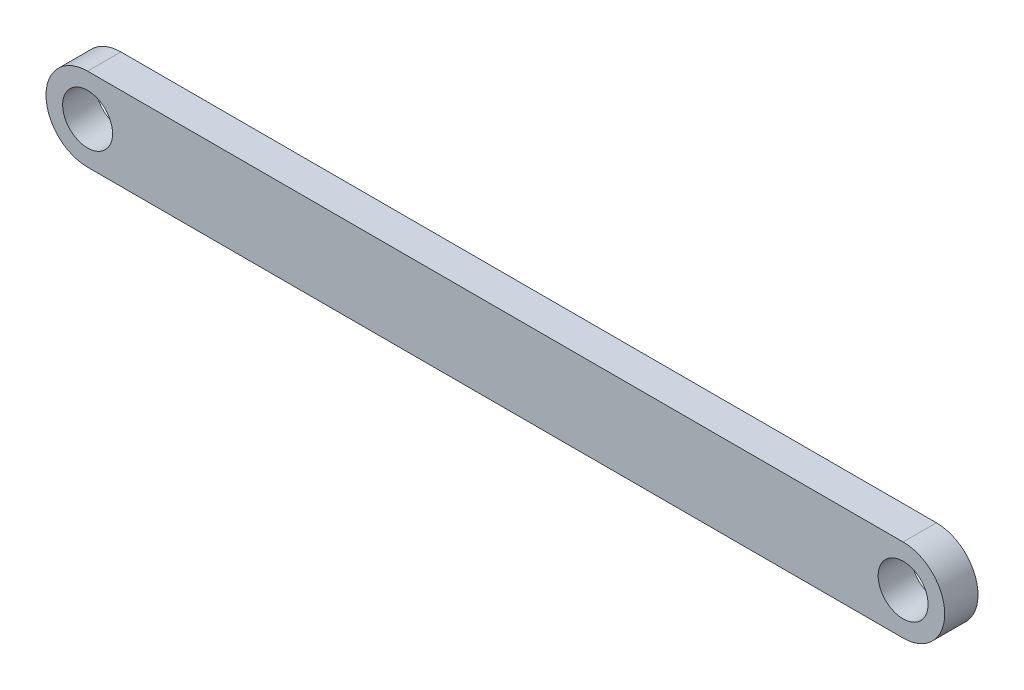
ISO-10303-21;
HEADER;
FILE_DESCRIPTION(('STEP AP214'),'2;1');
FILE_NAME('part.step','',(''),(''),'','','');
FILE_SCHEMA(('AUTOMOTIVE_DESIGN { 1 0 10303 214 1 1 1 1 }'));
ENDSEC;
DATA;
#1=APPLICATION_CONTEXT('core data for automotive mechanical design processes');
#2=APPLICATION_PROTOCOL_DEFINITION('international standard','automotive_design',2000,#1);
#3=PRODUCT_CONTEXT('',#1,'mechanical');
#4=PRODUCT('Part','Part','',(#3));
#5=PRODUCT_RELATED_PRODUCT_CATEGORY('part','',(#4));
#6=PRODUCT_DEFINITION_FORMATION('','',#4);
#7=PRODUCT_DEFINITION_CONTEXT('part definition',#1,'design');
#8=PRODUCT_DEFINITION('design','',#6,#7);
#9=PRODUCT_DEFINITION_SHAPE('','',#8);
#10=(LENGTH_UNIT() NAMED_UNIT(*) SI_UNIT(.MILLI.,.METRE.));
#11=(NAMED_UNIT(*) PLANE_ANGLE_UNIT() SI_UNIT($,.RADIAN.));
#12=(NAMED_UNIT(*) SI_UNIT($,.STERADIAN.) SOLID_ANGLE_UNIT());
#13=UNCERTAINTY_MEASURE_WITH_UNIT(LENGTH_MEASURE(1.E-05),#10,'distance_accuracy_value','');
#14=(GEOMETRIC_REPRESENTATION_CONTEXT(3) GLOBAL_UNCERTAINTY_ASSIGNED_CONTEXT((#13)) GLOBAL_UNIT_ASSIGNED_CONTEXT((#10,
#11,#12)) REPRESENTATION_CONTEXT('',''));
#15=CARTESIAN_POINT('',(0.,0.,0.));
#16=DIRECTION('',(0.,0.,1.));
#17=DIRECTION('',(1.,0.,0.));
#18=AXIS2_PLACEMENT_3D('',#15,#16,#17);
#19=CARTESIAN_POINT('',(0.0557614850425769,-0.167823658648234,2.));
#20=DIRECTION('',(0.,0.,1.));
#21=DIRECTION('',(1.,0.,0.));
#22=AXIS2_PLACEMENT_3D('',#19,#20,#21);
#23=PLANE('',#22);
#24=CARTESIAN_POINT('',(0.0557614850425769,-0.167823658648235,2.));
#25=DIRECTION('',(0.,0.,1.));
#26=DIRECTION('',(1.,0.,0.));
#27=AXIS2_PLACEMENT_3D('',#24,#25,#26);
#28=CIRCLE('',#27,1.5);
#29=CARTESIAN_POINT('',(1.55576148504258,-0.167823658648235,2.));
#30=VERTEX_POINT('',#29);
#31=EDGE_CURVE('E99',#30,#30,#28,.T.);
#32=ORIENTED_EDGE('',*,*,#31,.F.);
#33=EDGE_LOOP('',(#32));
#34=FACE_BOUND('',#33,.T.);
#35=CARTESIAN_POINT('',(0.0557614850425769,-0.167823658648234,2.));
#36=DIRECTION('',(0.,0.,1.));
#37=DIRECTION('',(1.,0.,0.));
#38=AXIS2_PLACEMENT_3D('',#35,#36,#37);
#39=CIRCLE('',#38,2.5);
#40=CARTESIAN_POINT('',(0.0557614850425769,2.33217634135177,2.));
#41=VERTEX_POINT('',#40);
#42=CARTESIAN_POINT('',(0.0557614850425769,-2.66782365864823,2.));
#43=VERTEX_POINT('',#42);
#44=EDGE_CURVE('E84',#41,#43,#39,.T.);
#45=ORIENTED_EDGE('',*,*,#44,.T.);
#46=DIRECTION('',(1.,0.,0.));
#47=VECTOR('',#46,1.);
#48=CARTESIAN_POINT('',(0.0557614850425769,-2.66782365864823,2.));
#49=LINE('',#48,#47);
#50=CARTESIAN_POINT('',(49.0557614850426,-2.66782365864823,2.));
#51=VERTEX_POINT('',#50);
#52=EDGE_CURVE('E79',#43,#51,#49,.T.);
#53=ORIENTED_EDGE('',*,*,#52,.T.);
#54=CARTESIAN_POINT('',(49.0557614850426,-0.167823658648234,2.));
#55=DIRECTION('',(0.,0.,1.));
#56=DIRECTION('',(1.,0.,0.));
#57=AXIS2_PLACEMENT_3D('',#54,#55,#56);
#58=CIRCLE('',#57,2.5);
#59=CARTESIAN_POINT('',(49.0557614850426,2.33217634135177,2.));
#60=VERTEX_POINT('',#59);
#61=EDGE_CURVE('E82',#51,#60,#58,.T.);
#62=ORIENTED_EDGE('',*,*,#61,.T.);
#63=DIRECTION('',(-1.,0.,0.));
#64=VECTOR('',#63,1.);
#65=CARTESIAN_POINT('',(0.0557614850425769,2.33217634135177,2.));
#66=LINE('',#65,#64);
#67=EDGE_CURVE('E49',#60,#41,#66,.T.);
#68=ORIENTED_EDGE('',*,*,#67,.T.);
#69=EDGE_LOOP('',(#45,#53,#62,#68));
#70=FACE_BOUND('',#69,.T.);
#71=CARTESIAN_POINT('',(49.0557614850426,-0.167823658648235,2.));
#72=DIRECTION('',(0.,0.,1.));
#73=DIRECTION('',(1.,0.,0.));
#74=AXIS2_PLACEMENT_3D('',#71,#72,#73);
#75=CIRCLE('',#74,1.5);
#76=CARTESIAN_POINT('',(50.5557614850426,-0.167823658648235,2.));
#77=VERTEX_POINT('',#76);
#78=EDGE_CURVE('E114',#77,#77,#75,.T.);
#79=ORIENTED_EDGE('',*,*,#78,.F.);
#80=EDGE_LOOP('',(#79));
#81=FACE_BOUND('',#80,.T.);
#82=ADVANCED_FACE('F32',(#34,#70,#81),#23,.T.);
#83=CARTESIAN_POINT('',(0.0557614850425769,-0.167823658648234,0.));
#84=DIRECTION('',(0.,0.,1.));
#85=DIRECTION('',(1.,0.,0.));
#86=AXIS2_PLACEMENT_3D('',#83,#84,#85);
#87=PLANE('',#86);
#88=CARTESIAN_POINT('',(0.0557614850425769,-0.167823658648234,0.));
#89=DIRECTION('',(0.,0.,1.));
#90=DIRECTION('',(1.,0.,0.));
#91=AXIS2_PLACEMENT_3D('',#88,#89,#90);
#92=CIRCLE('',#91,2.5);
#93=CARTESIAN_POINT('',(0.0557614850425769,2.33217634135177,0.));
#94=VERTEX_POINT('',#93);
#95=CARTESIAN_POINT('',(0.0557614850425769,-2.66782365864823,0.));
#96=VERTEX_POINT('',#95);
#97=EDGE_CURVE('E96',#94,#96,#92,.T.);
#98=ORIENTED_EDGE('',*,*,#97,.F.);
#99=DIRECTION('',(-1.,0.,0.));
#100=VECTOR('',#99,1.);
#101=CARTESIAN_POINT('',(0.0557614850425769,2.33217634135177,0.));
#102=LINE('',#101,#100);
#103=CARTESIAN_POINT('',(49.0557614850426,2.33217634135177,0.));
#104=VERTEX_POINT('',#103);
#105=EDGE_CURVE('E72',#104,#94,#102,.T.);
#106=ORIENTED_EDGE('',*,*,#105,.F.);
#107=CARTESIAN_POINT('',(49.0557614850426,-0.167823658648234,0.));
#108=DIRECTION('',(0.,0.,1.));
#109=DIRECTION('',(1.,0.,0.));
#110=AXIS2_PLACEMENT_3D('',#107,#108,#109);
#111=CIRCLE('',#110,2.5);
#112=CARTESIAN_POINT('',(49.0557614850426,-2.66782365864823,0.));
#113=VERTEX_POINT('',#112);
#114=EDGE_CURVE('E66',#113,#104,#111,.T.);
#115=ORIENTED_EDGE('',*,*,#114,.F.);
#116=DIRECTION('',(1.,0.,0.));
#117=VECTOR('',#116,1.);
#118=CARTESIAN_POINT('',(0.0557614850425769,-2.66782365864823,0.));
#119=LINE('',#118,#117);
#120=EDGE_CURVE('E88',#96,#113,#119,.T.);
#121=ORIENTED_EDGE('',*,*,#120,.F.);
#122=EDGE_LOOP('',(#98,#106,#115,#121));
#123=FACE_BOUND('',#122,.T.);
#124=CARTESIAN_POINT('',(0.0557614850425769,-0.167823658648235,0.));
#125=DIRECTION('',(0.,0.,1.));
#126=DIRECTION('',(1.,0.,0.));
#127=AXIS2_PLACEMENT_3D('',#124,#125,#126);
#128=CIRCLE('',#127,1.5);
#129=CARTESIAN_POINT('',(1.55576148504258,-0.167823658648235,0.));
#130=VERTEX_POINT('',#129);
#131=EDGE_CURVE('E111',#130,#130,#128,.T.);
#132=ORIENTED_EDGE('',*,*,#131,.T.);
#133=EDGE_LOOP('',(#132));
#134=FACE_BOUND('',#133,.T.);
#135=CARTESIAN_POINT('',(49.0557614850426,-0.167823658648235,0.));
#136=DIRECTION('',(0.,0.,1.));
#137=DIRECTION('',(1.,0.,0.));
#138=AXIS2_PLACEMENT_3D('',#135,#136,#137);
#139=CIRCLE('',#138,1.5);
#140=CARTESIAN_POINT('',(50.5557614850426,-0.167823658648235,0.));
#141=VERTEX_POINT('',#140);
#142=EDGE_CURVE('E117',#141,#141,#139,.T.);
#143=ORIENTED_EDGE('',*,*,#142,.T.);
#144=EDGE_LOOP('',(#143));
#145=FACE_BOUND('',#144,.T.);
#146=ADVANCED_FACE('F107',(#123,#134,#145),#87,.F.);
#147=CARTESIAN_POINT('',(0.0557614850425769,-0.167823658648234,2.));
#148=DIRECTION('',(0.,0.,-1.));
#149=DIRECTION('',(-1.,0.,0.));
#150=AXIS2_PLACEMENT_3D('',#147,#148,#149);
#151=CYLINDRICAL_SURFACE('',#150,2.5);
#152=ORIENTED_EDGE('',*,*,#97,.T.);
#153=DIRECTION('',(0.,0.,-1.));
#154=VECTOR('',#153,1.);
#155=CARTESIAN_POINT('',(0.0557614850425769,-2.66782365864823,2.));
#156=LINE('',#155,#154);
#157=EDGE_CURVE('E11',#43,#96,#156,.T.);
#158=ORIENTED_EDGE('',*,*,#157,.F.);
#159=ORIENTED_EDGE('',*,*,#44,.F.);
#160=DIRECTION('',(0.,0.,-1.));
#161=VECTOR('',#160,1.);
#162=CARTESIAN_POINT('',(0.0557614850425769,2.33217634135177,2.));
#163=LINE('',#162,#161);
#164=EDGE_CURVE('E92',#41,#94,#163,.T.);
#165=ORIENTED_EDGE('',*,*,#164,.T.);
#166=EDGE_LOOP('',(#152,#158,#159,#165));
#167=FACE_BOUND('',#166,.T.);
#168=ADVANCED_FACE('F34',(#167),#151,.T.);
#169=CARTESIAN_POINT('',(0.0557614850425769,-2.66782365864823,2.));
#170=DIRECTION('',(0.,1.,0.));
#171=DIRECTION('',(0.,0.,1.));
#172=AXIS2_PLACEMENT_3D('',#169,#170,#171);
#173=PLANE('',#172);
#174=ORIENTED_EDGE('',*,*,#120,.T.);
#175=DIRECTION('',(0.,0.,-1.));
#176=VECTOR('',#175,1.);
#177=CARTESIAN_POINT('',(49.0557614850426,-2.66782365864823,2.));
#178=LINE('',#177,#176);
#179=EDGE_CURVE('E41',#51,#113,#178,.T.);
#180=ORIENTED_EDGE('',*,*,#179,.F.);
#181=ORIENTED_EDGE('',*,*,#52,.F.);
#182=ORIENTED_EDGE('',*,*,#157,.T.);
#183=EDGE_LOOP('',(#174,#180,#181,#182));
#184=FACE_BOUND('',#183,.T.);
#185=ADVANCED_FACE('F87',(#184),#173,.F.);
#186=CARTESIAN_POINT('',(49.0557614850426,-0.167823658648234,2.));
#187=DIRECTION('',(0.,0.,-1.));
#188=DIRECTION('',(-1.,0.,0.));
#189=AXIS2_PLACEMENT_3D('',#186,#187,#188);
#190=CYLINDRICAL_SURFACE('',#189,2.5);
#191=ORIENTED_EDGE('',*,*,#114,.T.);
#192=DIRECTION('',(0.,0.,-1.));
#193=VECTOR('',#192,1.);
#194=CARTESIAN_POINT('',(49.0557614850426,2.33217634135177,2.));
#195=LINE('',#194,#193);
#196=EDGE_CURVE('E89',#60,#104,#195,.T.);
#197=ORIENTED_EDGE('',*,*,#196,.F.);
#198=ORIENTED_EDGE('',*,*,#61,.F.);
#199=ORIENTED_EDGE('',*,*,#179,.T.);
#200=EDGE_LOOP('',(#191,#197,#198,#199));
#201=FACE_BOUND('',#200,.T.);
#202=ADVANCED_FACE('F90',(#201),#190,.T.);
#203=CARTESIAN_POINT('',(0.0557614850425769,2.33217634135177,2.));
#204=DIRECTION('',(0.,-1.,0.));
#205=DIRECTION('',(0.,0.,-1.));
#206=AXIS2_PLACEMENT_3D('',#203,#204,#205);
#207=PLANE('',#206);
#208=ORIENTED_EDGE('',*,*,#105,.T.);
#209=ORIENTED_EDGE('',*,*,#164,.F.);
#210=ORIENTED_EDGE('',*,*,#67,.F.);
#211=ORIENTED_EDGE('',*,*,#196,.T.);
#212=EDGE_LOOP('',(#208,#209,#210,#211));
#213=FACE_BOUND('',#212,.T.);
#214=ADVANCED_FACE('F104',(#213),#207,.F.);
#215=CARTESIAN_POINT('',(0.0557614850425769,-0.167823658648235,2.));
#216=DIRECTION('',(0.,0.,-1.));
#217=DIRECTION('',(-1.,0.,0.));
#218=AXIS2_PLACEMENT_3D('',#215,#216,#217);
#219=CYLINDRICAL_SURFACE('',#218,1.5);
#220=ORIENTED_EDGE('',*,*,#31,.T.);
#221=EDGE_LOOP('',(#220));
#222=FACE_BOUND('',#221,.T.);
#223=ORIENTED_EDGE('',*,*,#131,.F.);
#224=EDGE_LOOP('',(#223));
#225=FACE_BOUND('',#224,.T.);
#226=ADVANCED_FACE('F134',(#222,#225),#219,.F.);
#227=CARTESIAN_POINT('',(49.0557614850426,-0.167823658648235,2.));
#228=DIRECTION('',(0.,0.,-1.));
#229=DIRECTION('',(-1.,0.,0.));
#230=AXIS2_PLACEMENT_3D('',#227,#228,#229);
#231=CYLINDRICAL_SURFACE('',#230,1.5);
#232=ORIENTED_EDGE('',*,*,#78,.T.);
#233=EDGE_LOOP('',(#232));
#234=FACE_BOUND('',#233,.T.);
#235=ORIENTED_EDGE('',*,*,#142,.F.);
#236=EDGE_LOOP('',(#235));
#237=FACE_BOUND('',#236,.T.);
#238=ADVANCED_FACE('F123',(#234,#237),#231,.F.);
#239=CLOSED_SHELL('',(#82,#146,#168,#185,#202,#214,#226,#238));
#240=MANIFOLD_SOLID_BREP('B2',#239);
#241=ADVANCED_BREP_SHAPE_REPRESENTATION('',(#18,#240),#14);
#242=SHAPE_DEFINITION_REPRESENTATION(#9,#241);
ENDSEC;
END-ISO-10303-21;
